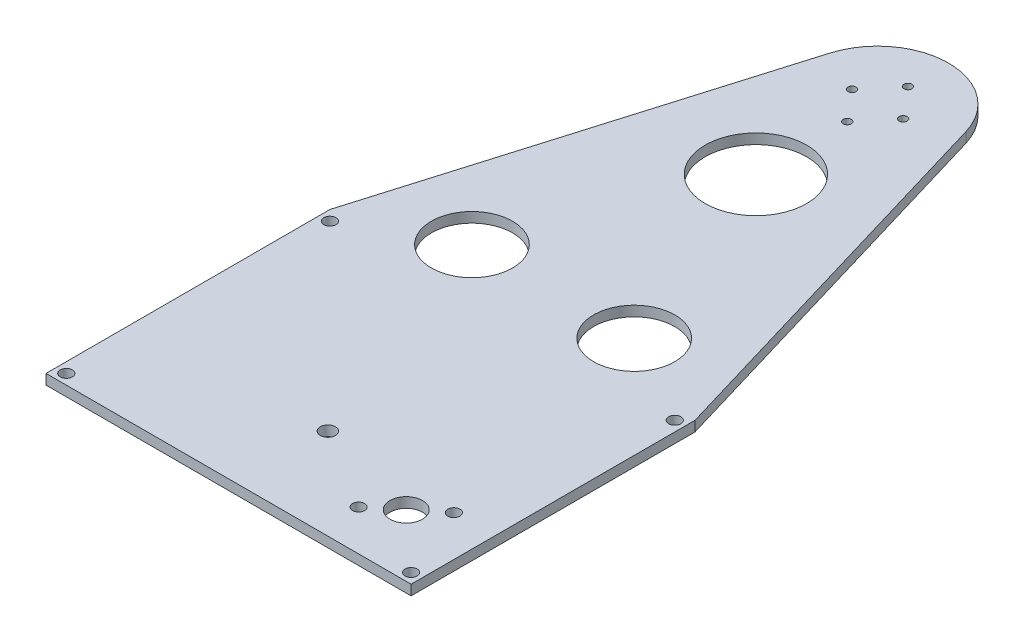
ISO-10303-21;
HEADER;
FILE_DESCRIPTION(('STEP AP214'),'2;1');
FILE_NAME('part.step','',(''),(''),'','','');
FILE_SCHEMA(('AUTOMOTIVE_DESIGN { 1 0 10303 214 1 1 1 1 }'));
ENDSEC;
DATA;
#1=APPLICATION_CONTEXT('core data for automotive mechanical design processes');
#2=APPLICATION_PROTOCOL_DEFINITION('international standard','automotive_design',2000,#1);
#3=PRODUCT_CONTEXT('',#1,'mechanical');
#4=PRODUCT('Part','Part','',(#3));
#5=PRODUCT_RELATED_PRODUCT_CATEGORY('part','',(#4));
#6=PRODUCT_DEFINITION_FORMATION('','',#4);
#7=PRODUCT_DEFINITION_CONTEXT('part definition',#1,'design');
#8=PRODUCT_DEFINITION('design','',#6,#7);
#9=PRODUCT_DEFINITION_SHAPE('','',#8);
#10=(LENGTH_UNIT() NAMED_UNIT(*) SI_UNIT(.MILLI.,.METRE.));
#11=(NAMED_UNIT(*) PLANE_ANGLE_UNIT() SI_UNIT($,.RADIAN.));
#12=(NAMED_UNIT(*) SI_UNIT($,.STERADIAN.) SOLID_ANGLE_UNIT());
#13=UNCERTAINTY_MEASURE_WITH_UNIT(LENGTH_MEASURE(1.E-05),#10,'distance_accuracy_value','');
#14=(GEOMETRIC_REPRESENTATION_CONTEXT(3) GLOBAL_UNCERTAINTY_ASSIGNED_CONTEXT((#13)) GLOBAL_UNIT_ASSIGNED_CONTEXT((#10,
#11,#12)) REPRESENTATION_CONTEXT('',''));
#15=CARTESIAN_POINT('',(0.,0.,0.));
#16=DIRECTION('',(0.,0.,1.));
#17=DIRECTION('',(1.,0.,0.));
#18=AXIS2_PLACEMENT_3D('',#15,#16,#17);
#19=CARTESIAN_POINT('',(0.,15.875,0.));
#20=DIRECTION('',(0.,-1.,0.));
#21=DIRECTION('',(0.,0.,-1.));
#22=AXIS2_PLACEMENT_3D('',#19,#20,#21);
#23=CYLINDRICAL_SURFACE('',#22,22.225);
#24=CARTESIAN_POINT('',(0.,12.7,0.));
#25=DIRECTION('',(0.,1.,0.));
#26=DIRECTION('',(0.,0.,-1.));
#27=AXIS2_PLACEMENT_3D('',#24,#25,#26);
#28=CIRCLE('',#27,22.225);
#29=CARTESIAN_POINT('',(21.3043132570412,12.7,-6.33062885074283));
#30=VERTEX_POINT('',#29);
#31=CARTESIAN_POINT('',(-21.3043132570412,12.7,-6.33062885074282));
#32=VERTEX_POINT('',#31);
#33=EDGE_CURVE('E127',#30,#32,#28,.T.);
#34=ORIENTED_EDGE('',*,*,#33,.T.);
#35=DIRECTION('',(0.,-1.,0.));
#36=VECTOR('',#35,1.);
#37=CARTESIAN_POINT('',(-21.3043132570412,15.875,-6.33062885074282));
#38=LINE('',#37,#36);
#39=CARTESIAN_POINT('',(-21.3043132570412,15.875,-6.33062885074282));
#40=VERTEX_POINT('',#39);
#41=EDGE_CURVE('E11',#40,#32,#38,.T.);
#42=ORIENTED_EDGE('',*,*,#41,.F.);
#43=CARTESIAN_POINT('',(0.,15.875,0.));
#44=DIRECTION('',(0.,1.,0.));
#45=DIRECTION('',(0.,0.,-1.));
#46=AXIS2_PLACEMENT_3D('',#43,#44,#45);
#47=CIRCLE('',#46,22.225);
#48=CARTESIAN_POINT('',(21.3043132570412,15.875,-6.33062885074283));
#49=VERTEX_POINT('',#48);
#50=EDGE_CURVE('E138',#49,#40,#47,.T.);
#51=ORIENTED_EDGE('',*,*,#50,.F.);
#52=DIRECTION('',(0.,-1.,0.));
#53=VECTOR('',#52,1.);
#54=CARTESIAN_POINT('',(21.3043132570412,15.875,-6.33062885074283));
#55=LINE('',#54,#53);
#56=EDGE_CURVE('E123',#49,#30,#55,.T.);
#57=ORIENTED_EDGE('',*,*,#56,.T.);
#58=EDGE_LOOP('',(#34,#42,#51,#57));
#59=FACE_BOUND('',#58,.T.);
#60=ADVANCED_FACE('F41',(#59),#23,.T.);
#61=CARTESIAN_POINT('',(-21.3043132570412,15.875,-6.33062885074282));
#62=DIRECTION('',(0.958574274782507,0.,0.284842692946809));
#63=DIRECTION('',(0.284842692946809,0.,-0.958574274782507));
#64=AXIS2_PLACEMENT_3D('',#61,#62,#63);
#65=PLANE('',#64);
#66=DIRECTION('',(-0.284842692946809,0.,0.958574274782507));
#67=VECTOR('',#66,1.);
#68=CARTESIAN_POINT('',(-21.3043132570412,12.7,-6.33062885074282));
#69=LINE('',#68,#67);
#70=CARTESIAN_POINT('',(-57.1499999999999,12.7,114.3));
#71=VERTEX_POINT('',#70);
#72=EDGE_CURVE('E130',#32,#71,#69,.T.);
#73=ORIENTED_EDGE('',*,*,#72,.T.);
#74=DIRECTION('',(0.,-1.,0.));
#75=VECTOR('',#74,1.);
#76=CARTESIAN_POINT('',(-57.1499999999999,15.875,114.3));
#77=LINE('',#76,#75);
#78=CARTESIAN_POINT('',(-57.1499999999999,15.875,114.3));
#79=VERTEX_POINT('',#78);
#80=EDGE_CURVE('E50',#79,#71,#77,.T.);
#81=ORIENTED_EDGE('',*,*,#80,.F.);
#82=DIRECTION('',(-0.284842692946809,0.,0.958574274782507));
#83=VECTOR('',#82,1.);
#84=CARTESIAN_POINT('',(-21.3043132570412,15.875,-6.33062885074282));
#85=LINE('',#84,#83);
#86=EDGE_CURVE('E96',#40,#79,#85,.T.);
#87=ORIENTED_EDGE('',*,*,#86,.F.);
#88=ORIENTED_EDGE('',*,*,#41,.T.);
#89=EDGE_LOOP('',(#73,#81,#87,#88));
#90=FACE_BOUND('',#89,.T.);
#91=ADVANCED_FACE('F218',(#90),#65,.F.);
#92=CARTESIAN_POINT('',(-57.1499999999999,15.875,114.3));
#93=DIRECTION('',(1.,0.,0.));
#94=DIRECTION('',(0.,0.,-1.));
#95=AXIS2_PLACEMENT_3D('',#92,#93,#94);
#96=PLANE('',#95);
#97=DIRECTION('',(0.,0.,1.));
#98=VECTOR('',#97,1.);
#99=CARTESIAN_POINT('',(-57.1499999999999,12.7,114.3));
#100=LINE('',#99,#98);
#101=CARTESIAN_POINT('',(-57.15,12.7,203.2));
#102=VERTEX_POINT('',#101);
#103=EDGE_CURVE('E133',#71,#102,#100,.T.);
#104=ORIENTED_EDGE('',*,*,#103,.T.);
#105=DIRECTION('',(0.,-1.,0.));
#106=VECTOR('',#105,1.);
#107=CARTESIAN_POINT('',(-57.15,15.875,203.2));
#108=LINE('',#107,#106);
#109=CARTESIAN_POINT('',(-57.15,15.875,203.2));
#110=VERTEX_POINT('',#109);
#111=EDGE_CURVE('E118',#110,#102,#108,.T.);
#112=ORIENTED_EDGE('',*,*,#111,.F.);
#113=DIRECTION('',(0.,0.,1.));
#114=VECTOR('',#113,1.);
#115=CARTESIAN_POINT('',(-57.1499999999999,15.875,114.3));
#116=LINE('',#115,#114);
#117=EDGE_CURVE('E109',#79,#110,#116,.T.);
#118=ORIENTED_EDGE('',*,*,#117,.F.);
#119=ORIENTED_EDGE('',*,*,#80,.T.);
#120=EDGE_LOOP('',(#104,#112,#118,#119));
#121=FACE_BOUND('',#120,.T.);
#122=ADVANCED_FACE('F221',(#121),#96,.F.);
#123=CARTESIAN_POINT('',(-57.15,15.875,203.2));
#124=DIRECTION('',(0.,0.,-1.));
#125=DIRECTION('',(-1.,0.,0.));
#126=AXIS2_PLACEMENT_3D('',#123,#124,#125);
#127=PLANE('',#126);
#128=DIRECTION('',(1.,0.,0.));
#129=VECTOR('',#128,1.);
#130=CARTESIAN_POINT('',(-57.15,12.7,203.2));
#131=LINE('',#130,#129);
#132=CARTESIAN_POINT('',(57.15,12.7,203.2));
#133=VERTEX_POINT('',#132);
#134=EDGE_CURVE('E117',#102,#133,#131,.T.);
#135=ORIENTED_EDGE('',*,*,#134,.T.);
#136=DIRECTION('',(0.,-1.,0.));
#137=VECTOR('',#136,1.);
#138=CARTESIAN_POINT('',(57.15,15.875,203.2));
#139=LINE('',#138,#137);
#140=CARTESIAN_POINT('',(57.15,15.875,203.2));
#141=VERTEX_POINT('',#140);
#142=EDGE_CURVE('E114',#141,#133,#139,.T.);
#143=ORIENTED_EDGE('',*,*,#142,.F.);
#144=DIRECTION('',(1.,0.,0.));
#145=VECTOR('',#144,1.);
#146=CARTESIAN_POINT('',(-57.15,15.875,203.2));
#147=LINE('',#146,#145);
#148=EDGE_CURVE('E103',#110,#141,#147,.T.);
#149=ORIENTED_EDGE('',*,*,#148,.F.);
#150=ORIENTED_EDGE('',*,*,#111,.T.);
#151=EDGE_LOOP('',(#135,#143,#149,#150));
#152=FACE_BOUND('',#151,.T.);
#153=ADVANCED_FACE('F115',(#152),#127,.F.);
#154=CARTESIAN_POINT('',(57.15,15.875,203.2));
#155=DIRECTION('',(-1.,0.,0.));
#156=DIRECTION('',(0.,0.,1.));
#157=AXIS2_PLACEMENT_3D('',#154,#155,#156);
#158=PLANE('',#157);
#159=DIRECTION('',(0.,0.,-1.));
#160=VECTOR('',#159,1.);
#161=CARTESIAN_POINT('',(57.15,12.7,203.2));
#162=LINE('',#161,#160);
#163=CARTESIAN_POINT('',(57.15,12.7,114.3));
#164=VERTEX_POINT('',#163);
#165=EDGE_CURVE('E82',#133,#164,#162,.T.);
#166=ORIENTED_EDGE('',*,*,#165,.T.);
#167=DIRECTION('',(0.,-1.,0.));
#168=VECTOR('',#167,1.);
#169=CARTESIAN_POINT('',(57.15,15.875,114.3));
#170=LINE('',#169,#168);
#171=CARTESIAN_POINT('',(57.15,15.875,114.3));
#172=VERTEX_POINT('',#171);
#173=EDGE_CURVE('E119',#172,#164,#170,.T.);
#174=ORIENTED_EDGE('',*,*,#173,.F.);
#175=DIRECTION('',(0.,0.,-1.));
#176=VECTOR('',#175,1.);
#177=CARTESIAN_POINT('',(57.15,15.875,203.2));
#178=LINE('',#177,#176);
#179=EDGE_CURVE('E107',#141,#172,#178,.T.);
#180=ORIENTED_EDGE('',*,*,#179,.F.);
#181=ORIENTED_EDGE('',*,*,#142,.T.);
#182=EDGE_LOOP('',(#166,#174,#180,#181));
#183=FACE_BOUND('',#182,.T.);
#184=ADVANCED_FACE('F121',(#183),#158,.F.);
#185=CARTESIAN_POINT('',(57.15,15.875,114.3));
#186=DIRECTION('',(-0.958574274782507,0.,0.284842692946809));
#187=DIRECTION('',(0.284842692946809,0.,0.958574274782507));
#188=AXIS2_PLACEMENT_3D('',#185,#186,#187);
#189=PLANE('',#188);
#190=DIRECTION('',(-0.284842692946809,0.,-0.958574274782507));
#191=VECTOR('',#190,1.);
#192=CARTESIAN_POINT('',(57.15,12.7,114.3));
#193=LINE('',#192,#191);
#194=EDGE_CURVE('E88',#164,#30,#193,.T.);
#195=ORIENTED_EDGE('',*,*,#194,.T.);
#196=ORIENTED_EDGE('',*,*,#56,.F.);
#197=DIRECTION('',(-0.284842692946809,0.,-0.958574274782507));
#198=VECTOR('',#197,1.);
#199=CARTESIAN_POINT('',(57.15,15.875,114.3));
#200=LINE('',#199,#198);
#201=EDGE_CURVE('E59',#172,#49,#200,.T.);
#202=ORIENTED_EDGE('',*,*,#201,.F.);
#203=ORIENTED_EDGE('',*,*,#173,.T.);
#204=EDGE_LOOP('',(#195,#196,#202,#203));
#205=FACE_BOUND('',#204,.T.);
#206=ADVANCED_FACE('F226',(#205),#189,.F.);
#207=CARTESIAN_POINT('',(0.,15.875,0.));
#208=DIRECTION('',(0.,-1.,0.));
#209=DIRECTION('',(0.,0.,-1.));
#210=AXIS2_PLACEMENT_3D('',#207,#208,#209);
#211=PLANE('',#210);
#212=CARTESIAN_POINT('',(0.,15.875,38.1));
#213=DIRECTION('',(0.,1.,0.));
#214=DIRECTION('',(0.,0.,1.));
#215=AXIS2_PLACEMENT_3D('',#212,#213,#214);
#216=CIRCLE('',#215,15.875);
#217=CARTESIAN_POINT('',(0.,15.875,53.975));
#218=VERTEX_POINT('',#217);
#219=EDGE_CURVE('E147',#218,#218,#216,.T.);
#220=ORIENTED_EDGE('',*,*,#219,.F.);
#221=EDGE_LOOP('',(#220));
#222=FACE_BOUND('',#221,.T.);
#223=CARTESIAN_POINT('',(-25.4,15.875,101.6));
#224=DIRECTION('',(0.,1.,0.));
#225=DIRECTION('',(0.,0.,1.));
#226=AXIS2_PLACEMENT_3D('',#223,#224,#225);
#227=CIRCLE('',#226,12.7);
#228=CARTESIAN_POINT('',(-25.4,15.875,114.3));
#229=VERTEX_POINT('',#228);
#230=EDGE_CURVE('E487',#229,#229,#227,.T.);
#231=ORIENTED_EDGE('',*,*,#230,.F.);
#232=EDGE_LOOP('',(#231));
#233=FACE_BOUND('',#232,.T.);
#234=CARTESIAN_POINT('',(25.4,15.875,101.6));
#235=DIRECTION('',(0.,1.,0.));
#236=DIRECTION('',(0.,0.,1.));
#237=AXIS2_PLACEMENT_3D('',#234,#235,#236);
#238=CIRCLE('',#237,12.7);
#239=CARTESIAN_POINT('',(25.4,15.875,114.3));
#240=VERTEX_POINT('',#239);
#241=EDGE_CURVE('E490',#240,#240,#238,.T.);
#242=ORIENTED_EDGE('',*,*,#241,.F.);
#243=EDGE_LOOP('',(#242));
#244=FACE_BOUND('',#243,.T.);
#245=CARTESIAN_POINT('',(0.,15.875,-9.5));
#246=DIRECTION('',(0.,1.,0.));
#247=DIRECTION('',(0.,0.,1.));
#248=AXIS2_PLACEMENT_3D('',#245,#246,#247);
#249=CIRCLE('',#248,1.25);
#250=CARTESIAN_POINT('',(0.,15.875,-8.25));
#251=VERTEX_POINT('',#250);
#252=EDGE_CURVE('E495',#251,#251,#249,.T.);
#253=ORIENTED_EDGE('',*,*,#252,.F.);
#254=EDGE_LOOP('',(#253));
#255=FACE_BOUND('',#254,.T.);
#256=CARTESIAN_POINT('',(0.,15.875,9.5));
#257=DIRECTION('',(0.,1.,0.));
#258=DIRECTION('',(0.,0.,1.));
#259=AXIS2_PLACEMENT_3D('',#256,#257,#258);
#260=CIRCLE('',#259,1.25);
#261=CARTESIAN_POINT('',(0.,15.875,10.75));
#262=VERTEX_POINT('',#261);
#263=EDGE_CURVE('E501',#262,#262,#260,.T.);
#264=ORIENTED_EDGE('',*,*,#263,.F.);
#265=EDGE_LOOP('',(#264));
#266=FACE_BOUND('',#265,.T.);
#267=CARTESIAN_POINT('',(-8.,15.875,0.));
#268=DIRECTION('',(0.,1.,0.));
#269=DIRECTION('',(0.,0.,1.));
#270=AXIS2_PLACEMENT_3D('',#267,#268,#269);
#271=CIRCLE('',#270,1.25);
#272=CARTESIAN_POINT('',(-8.,15.875,1.25));
#273=VERTEX_POINT('',#272);
#274=EDGE_CURVE('E161',#273,#273,#271,.T.);
#275=ORIENTED_EDGE('',*,*,#274,.F.);
#276=EDGE_LOOP('',(#275));
#277=FACE_BOUND('',#276,.T.);
#278=CARTESIAN_POINT('',(8.,15.875,0.));
#279=DIRECTION('',(0.,1.,0.));
#280=DIRECTION('',(0.,0.,1.));
#281=AXIS2_PLACEMENT_3D('',#278,#279,#280);
#282=CIRCLE('',#281,1.25);
#283=CARTESIAN_POINT('',(8.,15.875,1.25));
#284=VERTEX_POINT('',#283);
#285=EDGE_CURVE('E152',#284,#284,#282,.T.);
#286=ORIENTED_EDGE('',*,*,#285,.F.);
#287=EDGE_LOOP('',(#286));
#288=FACE_BOUND('',#287,.T.);
#289=CARTESIAN_POINT('',(2.61501830703343,15.875,174.727283435361));
#290=DIRECTION('',(0.,1.,0.));
#291=DIRECTION('',(0.,0.,1.));
#292=AXIS2_PLACEMENT_3D('',#289,#290,#291);
#293=CIRCLE('',#292,2.38125);
#294=CARTESIAN_POINT('',(2.61501830703343,15.875,177.108533435361));
#295=VERTEX_POINT('',#294);
#296=EDGE_CURVE('E181',#295,#295,#293,.T.);
#297=ORIENTED_EDGE('',*,*,#296,.F.);
#298=EDGE_LOOP('',(#297));
#299=FACE_BOUND('',#298,.T.);
#300=CARTESIAN_POINT('',(28.0150183070334,15.875,190.5));
#301=DIRECTION('',(0.,1.,0.));
#302=DIRECTION('',(0.,0.,1.));
#303=AXIS2_PLACEMENT_3D('',#300,#301,#302);
#304=CIRCLE('',#303,1.90499999999999);
#305=CARTESIAN_POINT('',(28.0150183070334,15.875,192.405));
#306=VERTEX_POINT('',#305);
#307=EDGE_CURVE('E175',#306,#306,#304,.T.);
#308=ORIENTED_EDGE('',*,*,#307,.F.);
#309=EDGE_LOOP('',(#308));
#310=FACE_BOUND('',#309,.T.);
#311=CARTESIAN_POINT('',(44.45,15.875,177.108533435361));
#312=DIRECTION('',(0.,1.,0.));
#313=DIRECTION('',(0.,0.,1.));
#314=AXIS2_PLACEMENT_3D('',#311,#312,#313);
#315=CIRCLE('',#314,1.90499999999999);
#316=CARTESIAN_POINT('',(44.45,15.875,179.013533435361));
#317=VERTEX_POINT('',#316);
#318=EDGE_CURVE('E167',#317,#317,#315,.T.);
#319=ORIENTED_EDGE('',*,*,#318,.F.);
#320=EDGE_LOOP('',(#319));
#321=FACE_BOUND('',#320,.T.);
#322=CARTESIAN_POINT('',(36.2325091535167,15.875,183.80426671768));
#323=DIRECTION('',(0.,1.,0.));
#324=DIRECTION('',(0.,0.,1.));
#325=AXIS2_PLACEMENT_3D('',#322,#323,#324);
#326=CIRCLE('',#325,5.07999999999999);
#327=CARTESIAN_POINT('',(36.2325091535167,15.875,188.88426671768));
#328=VERTEX_POINT('',#327);
#329=EDGE_CURVE('E174',#328,#328,#326,.T.);
#330=ORIENTED_EDGE('',*,*,#329,.F.);
#331=EDGE_LOOP('',(#330));
#332=FACE_BOUND('',#331,.T.);
#333=CARTESIAN_POINT('',(53.975,15.875,117.475));
#334=DIRECTION('',(0.,1.,0.));
#335=DIRECTION('',(0.,0.,1.));
#336=AXIS2_PLACEMENT_3D('',#333,#334,#335);
#337=CIRCLE('',#336,1.90500000000001);
#338=CARTESIAN_POINT('',(53.975,15.875,119.38));
#339=VERTEX_POINT('',#338);
#340=EDGE_CURVE('E192',#339,#339,#337,.T.);
#341=ORIENTED_EDGE('',*,*,#340,.F.);
#342=EDGE_LOOP('',(#341));
#343=FACE_BOUND('',#342,.T.);
#344=CARTESIAN_POINT('',(53.975,15.875,200.025));
#345=DIRECTION('',(0.,1.,0.));
#346=DIRECTION('',(0.,0.,1.));
#347=AXIS2_PLACEMENT_3D('',#344,#345,#346);
#348=CIRCLE('',#347,1.905);
#349=CARTESIAN_POINT('',(53.975,15.875,201.93));
#350=VERTEX_POINT('',#349);
#351=EDGE_CURVE('E201',#350,#350,#348,.T.);
#352=ORIENTED_EDGE('',*,*,#351,.F.);
#353=EDGE_LOOP('',(#352));
#354=FACE_BOUND('',#353,.T.);
#355=CARTESIAN_POINT('',(-53.975,15.875,200.025));
#356=DIRECTION('',(0.,1.,0.));
#357=DIRECTION('',(0.,0.,1.));
#358=AXIS2_PLACEMENT_3D('',#355,#356,#357);
#359=CIRCLE('',#358,1.905);
#360=CARTESIAN_POINT('',(-53.975,15.875,201.93));
#361=VERTEX_POINT('',#360);
#362=EDGE_CURVE('E193',#361,#361,#359,.T.);
#363=ORIENTED_EDGE('',*,*,#362,.F.);
#364=EDGE_LOOP('',(#363));
#365=FACE_BOUND('',#364,.T.);
#366=CARTESIAN_POINT('',(-53.975,15.875,117.475));
#367=DIRECTION('',(0.,1.,0.));
#368=DIRECTION('',(0.,0.,1.));
#369=AXIS2_PLACEMENT_3D('',#366,#367,#368);
#370=CIRCLE('',#369,1.90500000000001);
#371=CARTESIAN_POINT('',(-53.975,15.875,119.38));
#372=VERTEX_POINT('',#371);
#373=EDGE_CURVE('E200',#372,#372,#370,.T.);
#374=ORIENTED_EDGE('',*,*,#373,.F.);
#375=EDGE_LOOP('',(#374));
#376=FACE_BOUND('',#375,.T.);
#377=ORIENTED_EDGE('',*,*,#50,.T.);
#378=ORIENTED_EDGE('',*,*,#86,.T.);
#379=ORIENTED_EDGE('',*,*,#117,.T.);
#380=ORIENTED_EDGE('',*,*,#148,.T.);
#381=ORIENTED_EDGE('',*,*,#179,.T.);
#382=ORIENTED_EDGE('',*,*,#201,.T.);
#383=EDGE_LOOP('',(#377,#378,#379,#380,#381,#382));
#384=FACE_BOUND('',#383,.T.);
#385=ADVANCED_FACE('F105',(#222,#233,#244,#255,#266,#277,#288,#299,#310,#321,#332,#343,#354,
#365,#376,#384),#211,.F.);
#386=CARTESIAN_POINT('',(0.,12.7,0.));
#387=DIRECTION('',(0.,-1.,0.));
#388=DIRECTION('',(0.,0.,-1.));
#389=AXIS2_PLACEMENT_3D('',#386,#387,#388);
#390=PLANE('',#389);
#391=CARTESIAN_POINT('',(0.,12.7,38.1));
#392=DIRECTION('',(0.,-1.,0.));
#393=DIRECTION('',(0.,0.,-1.));
#394=AXIS2_PLACEMENT_3D('',#391,#392,#393);
#395=CIRCLE('',#394,15.875);
#396=CARTESIAN_POINT('',(0.,12.7,22.225));
#397=VERTEX_POINT('',#396);
#398=EDGE_CURVE('E44',#397,#397,#395,.T.);
#399=ORIENTED_EDGE('',*,*,#398,.F.);
#400=EDGE_LOOP('',(#399));
#401=FACE_BOUND('',#400,.T.);
#402=CARTESIAN_POINT('',(-25.4,12.7,101.6));
#403=DIRECTION('',(0.,-1.,0.));
#404=DIRECTION('',(0.,0.,-1.));
#405=AXIS2_PLACEMENT_3D('',#402,#403,#404);
#406=CIRCLE('',#405,12.7);
#407=CARTESIAN_POINT('',(-25.4,12.7,88.9));
#408=VERTEX_POINT('',#407);
#409=EDGE_CURVE('E146',#408,#408,#406,.T.);
#410=ORIENTED_EDGE('',*,*,#409,.F.);
#411=EDGE_LOOP('',(#410));
#412=FACE_BOUND('',#411,.T.);
#413=CARTESIAN_POINT('',(25.4,12.7,101.6));
#414=DIRECTION('',(0.,-1.,0.));
#415=DIRECTION('',(0.,0.,-1.));
#416=AXIS2_PLACEMENT_3D('',#413,#414,#415);
#417=CIRCLE('',#416,12.7);
#418=CARTESIAN_POINT('',(25.4,12.7,88.9));
#419=VERTEX_POINT('',#418);
#420=EDGE_CURVE('E144',#419,#419,#417,.T.);
#421=ORIENTED_EDGE('',*,*,#420,.F.);
#422=EDGE_LOOP('',(#421));
#423=FACE_BOUND('',#422,.T.);
#424=CARTESIAN_POINT('',(0.,12.7,-9.5));
#425=DIRECTION('',(0.,-1.,0.));
#426=DIRECTION('',(0.,0.,-1.));
#427=AXIS2_PLACEMENT_3D('',#424,#425,#426);
#428=CIRCLE('',#427,1.25);
#429=CARTESIAN_POINT('',(0.,12.7,-10.75));
#430=VERTEX_POINT('',#429);
#431=EDGE_CURVE('E184',#430,#430,#428,.F.);
#432=ORIENTED_EDGE('',*,*,#431,.T.);
#433=EDGE_LOOP('',(#432));
#434=FACE_BOUND('',#433,.T.);
#435=CARTESIAN_POINT('',(0.,12.7,9.5));
#436=DIRECTION('',(0.,-1.,0.));
#437=DIRECTION('',(0.,0.,-1.));
#438=AXIS2_PLACEMENT_3D('',#435,#436,#437);
#439=CIRCLE('',#438,1.25);
#440=CARTESIAN_POINT('',(0.,12.7,8.25));
#441=VERTEX_POINT('',#440);
#442=EDGE_CURVE('E498',#441,#441,#439,.F.);
#443=ORIENTED_EDGE('',*,*,#442,.T.);
#444=EDGE_LOOP('',(#443));
#445=FACE_BOUND('',#444,.T.);
#446=CARTESIAN_POINT('',(-8.,12.7,0.));
#447=DIRECTION('',(0.,-1.,0.));
#448=DIRECTION('',(0.,0.,-1.));
#449=AXIS2_PLACEMENT_3D('',#446,#447,#448);
#450=CIRCLE('',#449,1.25);
#451=CARTESIAN_POINT('',(-8.,12.7,-1.25));
#452=VERTEX_POINT('',#451);
#453=EDGE_CURVE('E164',#452,#452,#450,.F.);
#454=ORIENTED_EDGE('',*,*,#453,.T.);
#455=EDGE_LOOP('',(#454));
#456=FACE_BOUND('',#455,.T.);
#457=CARTESIAN_POINT('',(8.,12.7,0.));
#458=DIRECTION('',(0.,-1.,0.));
#459=DIRECTION('',(0.,0.,-1.));
#460=AXIS2_PLACEMENT_3D('',#457,#458,#459);
#461=CIRCLE('',#460,1.25);
#462=CARTESIAN_POINT('',(8.,12.7,-1.25));
#463=VERTEX_POINT('',#462);
#464=EDGE_CURVE('E156',#463,#463,#461,.F.);
#465=ORIENTED_EDGE('',*,*,#464,.T.);
#466=EDGE_LOOP('',(#465));
#467=FACE_BOUND('',#466,.T.);
#468=CARTESIAN_POINT('',(2.61501830703343,12.7,174.727283435361));
#469=DIRECTION('',(0.,-1.,0.));
#470=DIRECTION('',(0.,0.,-1.));
#471=AXIS2_PLACEMENT_3D('',#468,#469,#470);
#472=CIRCLE('',#471,2.38125);
#473=CARTESIAN_POINT('',(2.61501830703343,12.7,172.346033435361));
#474=VERTEX_POINT('',#473);
#475=EDGE_CURVE('E178',#474,#474,#472,.F.);
#476=ORIENTED_EDGE('',*,*,#475,.T.);
#477=EDGE_LOOP('',(#476));
#478=FACE_BOUND('',#477,.T.);
#479=CARTESIAN_POINT('',(28.0150183070334,12.7,190.5));
#480=DIRECTION('',(0.,-1.,0.));
#481=DIRECTION('',(0.,0.,-1.));
#482=AXIS2_PLACEMENT_3D('',#479,#480,#481);
#483=CIRCLE('',#482,1.90499999999999);
#484=CARTESIAN_POINT('',(28.0150183070334,12.7,188.595));
#485=VERTEX_POINT('',#484);
#486=EDGE_CURVE('E171',#485,#485,#483,.F.);
#487=ORIENTED_EDGE('',*,*,#486,.T.);
#488=EDGE_LOOP('',(#487));
#489=FACE_BOUND('',#488,.T.);
#490=CARTESIAN_POINT('',(44.45,12.7,177.108533435361));
#491=DIRECTION('',(0.,-1.,0.));
#492=DIRECTION('',(0.,0.,-1.));
#493=AXIS2_PLACEMENT_3D('',#490,#491,#492);
#494=CIRCLE('',#493,1.90499999999999);
#495=CARTESIAN_POINT('',(44.45,12.7,175.203533435361));
#496=VERTEX_POINT('',#495);
#497=EDGE_CURVE('E170',#496,#496,#494,.F.);
#498=ORIENTED_EDGE('',*,*,#497,.T.);
#499=EDGE_LOOP('',(#498));
#500=FACE_BOUND('',#499,.T.);
#501=CARTESIAN_POINT('',(36.2325091535167,12.7,183.80426671768));
#502=DIRECTION('',(0.,-1.,0.));
#503=DIRECTION('',(0.,0.,-1.));
#504=AXIS2_PLACEMENT_3D('',#501,#502,#503);
#505=CIRCLE('',#504,5.07999999999999);
#506=CARTESIAN_POINT('',(36.2325091535167,12.7,178.72426671768));
#507=VERTEX_POINT('',#506);
#508=EDGE_CURVE('E189',#507,#507,#505,.F.);
#509=ORIENTED_EDGE('',*,*,#508,.T.);
#510=EDGE_LOOP('',(#509));
#511=FACE_BOUND('',#510,.T.);
#512=CARTESIAN_POINT('',(53.975,12.7,117.475));
#513=DIRECTION('',(0.,-1.,0.));
#514=DIRECTION('',(0.,0.,-1.));
#515=AXIS2_PLACEMENT_3D('',#512,#513,#514);
#516=CIRCLE('',#515,1.90500000000001);
#517=CARTESIAN_POINT('',(53.975,12.7,115.57));
#518=VERTEX_POINT('',#517);
#519=EDGE_CURVE('E204',#518,#518,#516,.F.);
#520=ORIENTED_EDGE('',*,*,#519,.T.);
#521=EDGE_LOOP('',(#520));
#522=FACE_BOUND('',#521,.T.);
#523=CARTESIAN_POINT('',(53.975,12.7,200.025));
#524=DIRECTION('',(0.,-1.,0.));
#525=DIRECTION('',(0.,0.,-1.));
#526=AXIS2_PLACEMENT_3D('',#523,#524,#525);
#527=CIRCLE('',#526,1.905);
#528=CARTESIAN_POINT('',(53.975,12.7,198.12));
#529=VERTEX_POINT('',#528);
#530=EDGE_CURVE('E197',#529,#529,#527,.F.);
#531=ORIENTED_EDGE('',*,*,#530,.T.);
#532=EDGE_LOOP('',(#531));
#533=FACE_BOUND('',#532,.T.);
#534=CARTESIAN_POINT('',(-53.975,12.7,200.025));
#535=DIRECTION('',(0.,-1.,0.));
#536=DIRECTION('',(0.,0.,-1.));
#537=AXIS2_PLACEMENT_3D('',#534,#535,#536);
#538=CIRCLE('',#537,1.905);
#539=CARTESIAN_POINT('',(-53.975,12.7,198.12));
#540=VERTEX_POINT('',#539);
#541=EDGE_CURVE('E196',#540,#540,#538,.F.);
#542=ORIENTED_EDGE('',*,*,#541,.T.);
#543=EDGE_LOOP('',(#542));
#544=FACE_BOUND('',#543,.T.);
#545=CARTESIAN_POINT('',(-53.975,12.7,117.475));
#546=DIRECTION('',(0.,-1.,0.));
#547=DIRECTION('',(0.,0.,-1.));
#548=AXIS2_PLACEMENT_3D('',#545,#546,#547);
#549=CIRCLE('',#548,1.90500000000001);
#550=CARTESIAN_POINT('',(-53.975,12.7,115.57));
#551=VERTEX_POINT('',#550);
#552=EDGE_CURVE('E131',#551,#551,#549,.F.);
#553=ORIENTED_EDGE('',*,*,#552,.T.);
#554=EDGE_LOOP('',(#553));
#555=FACE_BOUND('',#554,.T.);
#556=ORIENTED_EDGE('',*,*,#33,.F.);
#557=ORIENTED_EDGE('',*,*,#194,.F.);
#558=ORIENTED_EDGE('',*,*,#165,.F.);
#559=ORIENTED_EDGE('',*,*,#134,.F.);
#560=ORIENTED_EDGE('',*,*,#103,.F.);
#561=ORIENTED_EDGE('',*,*,#72,.F.);
#562=EDGE_LOOP('',(#556,#557,#558,#559,#560,#561));
#563=FACE_BOUND('',#562,.T.);
#564=ADVANCED_FACE('F224',(#401,#412,#423,#434,#445,#456,#467,#478,#489,#500,#511,#522,#533,
#544,#555,#563),#390,.T.);
#565=CARTESIAN_POINT('',(-53.975,7.31184632735848,117.475));
#566=DIRECTION('',(0.,1.,0.));
#567=DIRECTION('',(0.,0.,1.));
#568=AXIS2_PLACEMENT_3D('',#565,#566,#567);
#569=CYLINDRICAL_SURFACE('',#568,1.90500000000001);
#570=ORIENTED_EDGE('',*,*,#373,.T.);
#571=EDGE_LOOP('',(#570));
#572=FACE_BOUND('',#571,.T.);
#573=ORIENTED_EDGE('',*,*,#552,.F.);
#574=EDGE_LOOP('',(#573));
#575=FACE_BOUND('',#574,.T.);
#576=ADVANCED_FACE('F267',(#572,#575),#569,.F.);
#577=CARTESIAN_POINT('',(-53.975,7.31184632735848,200.025));
#578=DIRECTION('',(0.,1.,0.));
#579=DIRECTION('',(0.,0.,1.));
#580=AXIS2_PLACEMENT_3D('',#577,#578,#579);
#581=CYLINDRICAL_SURFACE('',#580,1.905);
#582=ORIENTED_EDGE('',*,*,#362,.T.);
#583=EDGE_LOOP('',(#582));
#584=FACE_BOUND('',#583,.T.);
#585=ORIENTED_EDGE('',*,*,#541,.F.);
#586=EDGE_LOOP('',(#585));
#587=FACE_BOUND('',#586,.T.);
#588=ADVANCED_FACE('F272',(#584,#587),#581,.F.);
#589=CARTESIAN_POINT('',(53.975,7.31184632735848,200.025));
#590=DIRECTION('',(0.,1.,0.));
#591=DIRECTION('',(0.,0.,1.));
#592=AXIS2_PLACEMENT_3D('',#589,#590,#591);
#593=CYLINDRICAL_SURFACE('',#592,1.905);
#594=ORIENTED_EDGE('',*,*,#351,.T.);
#595=EDGE_LOOP('',(#594));
#596=FACE_BOUND('',#595,.T.);
#597=ORIENTED_EDGE('',*,*,#530,.F.);
#598=EDGE_LOOP('',(#597));
#599=FACE_BOUND('',#598,.T.);
#600=ADVANCED_FACE('F285',(#596,#599),#593,.F.);
#601=CARTESIAN_POINT('',(53.975,7.31184632735848,117.475));
#602=DIRECTION('',(0.,1.,0.));
#603=DIRECTION('',(0.,0.,1.));
#604=AXIS2_PLACEMENT_3D('',#601,#602,#603);
#605=CYLINDRICAL_SURFACE('',#604,1.90500000000001);
#606=ORIENTED_EDGE('',*,*,#340,.T.);
#607=EDGE_LOOP('',(#606));
#608=FACE_BOUND('',#607,.T.);
#609=ORIENTED_EDGE('',*,*,#519,.F.);
#610=EDGE_LOOP('',(#609));
#611=FACE_BOUND('',#610,.T.);
#612=ADVANCED_FACE('F296',(#608,#611),#605,.F.);
#613=CARTESIAN_POINT('',(36.2325091535167,-1.66840979371064,183.80426671768));
#614=DIRECTION('',(0.,1.,0.));
#615=DIRECTION('',(0.,0.,1.));
#616=AXIS2_PLACEMENT_3D('',#613,#614,#615);
#617=CYLINDRICAL_SURFACE('',#616,5.07999999999999);
#618=ORIENTED_EDGE('',*,*,#329,.T.);
#619=EDGE_LOOP('',(#618));
#620=FACE_BOUND('',#619,.T.);
#621=ORIENTED_EDGE('',*,*,#508,.F.);
#622=EDGE_LOOP('',(#621));
#623=FACE_BOUND('',#622,.T.);
#624=ADVANCED_FACE('F307',(#620,#623),#617,.F.);
#625=CARTESIAN_POINT('',(44.45,-1.66840979371064,177.108533435361));
#626=DIRECTION('',(0.,1.,0.));
#627=DIRECTION('',(0.,0.,1.));
#628=AXIS2_PLACEMENT_3D('',#625,#626,#627);
#629=CYLINDRICAL_SURFACE('',#628,1.90499999999999);
#630=ORIENTED_EDGE('',*,*,#318,.T.);
#631=EDGE_LOOP('',(#630));
#632=FACE_BOUND('',#631,.T.);
#633=ORIENTED_EDGE('',*,*,#497,.F.);
#634=EDGE_LOOP('',(#633));
#635=FACE_BOUND('',#634,.T.);
#636=ADVANCED_FACE('F318',(#632,#635),#629,.F.);
#637=CARTESIAN_POINT('',(28.0150183070334,-1.66840979371064,190.5));
#638=DIRECTION('',(0.,1.,0.));
#639=DIRECTION('',(0.,0.,1.));
#640=AXIS2_PLACEMENT_3D('',#637,#638,#639);
#641=CYLINDRICAL_SURFACE('',#640,1.90499999999999);
#642=ORIENTED_EDGE('',*,*,#307,.T.);
#643=EDGE_LOOP('',(#642));
#644=FACE_BOUND('',#643,.T.);
#645=ORIENTED_EDGE('',*,*,#486,.F.);
#646=EDGE_LOOP('',(#645));
#647=FACE_BOUND('',#646,.T.);
#648=ADVANCED_FACE('F329',(#644,#647),#641,.F.);
#649=CARTESIAN_POINT('',(2.61501830703343,-1.66840979371064,174.727283435361));
#650=DIRECTION('',(0.,1.,0.));
#651=DIRECTION('',(0.,0.,1.));
#652=AXIS2_PLACEMENT_3D('',#649,#650,#651);
#653=CYLINDRICAL_SURFACE('',#652,2.38125);
#654=ORIENTED_EDGE('',*,*,#296,.T.);
#655=EDGE_LOOP('',(#654));
#656=FACE_BOUND('',#655,.T.);
#657=ORIENTED_EDGE('',*,*,#475,.F.);
#658=EDGE_LOOP('',(#657));
#659=FACE_BOUND('',#658,.T.);
#660=ADVANCED_FACE('F340',(#656,#659),#653,.F.);
#661=CARTESIAN_POINT('',(8.,9.16446609406726,0.));
#662=DIRECTION('',(0.,1.,0.));
#663=DIRECTION('',(0.,0.,1.));
#664=AXIS2_PLACEMENT_3D('',#661,#662,#663);
#665=CYLINDRICAL_SURFACE('',#664,1.25);
#666=ORIENTED_EDGE('',*,*,#285,.T.);
#667=EDGE_LOOP('',(#666));
#668=FACE_BOUND('',#667,.T.);
#669=ORIENTED_EDGE('',*,*,#464,.F.);
#670=EDGE_LOOP('',(#669));
#671=FACE_BOUND('',#670,.T.);
#672=ADVANCED_FACE('F351',(#668,#671),#665,.F.);
#673=CARTESIAN_POINT('',(-8.,9.16446609406726,0.));
#674=DIRECTION('',(0.,1.,0.));
#675=DIRECTION('',(0.,0.,1.));
#676=AXIS2_PLACEMENT_3D('',#673,#674,#675);
#677=CYLINDRICAL_SURFACE('',#676,1.25);
#678=ORIENTED_EDGE('',*,*,#274,.T.);
#679=EDGE_LOOP('',(#678));
#680=FACE_BOUND('',#679,.T.);
#681=ORIENTED_EDGE('',*,*,#453,.F.);
#682=EDGE_LOOP('',(#681));
#683=FACE_BOUND('',#682,.T.);
#684=ADVANCED_FACE('F362',(#680,#683),#677,.F.);
#685=CARTESIAN_POINT('',(0.,9.16446609406726,9.5));
#686=DIRECTION('',(0.,1.,0.));
#687=DIRECTION('',(0.,0.,1.));
#688=AXIS2_PLACEMENT_3D('',#685,#686,#687);
#689=CYLINDRICAL_SURFACE('',#688,1.25);
#690=ORIENTED_EDGE('',*,*,#263,.T.);
#691=EDGE_LOOP('',(#690));
#692=FACE_BOUND('',#691,.T.);
#693=ORIENTED_EDGE('',*,*,#442,.F.);
#694=EDGE_LOOP('',(#693));
#695=FACE_BOUND('',#694,.T.);
#696=ADVANCED_FACE('F372',(#692,#695),#689,.F.);
#697=CARTESIAN_POINT('',(0.,9.16446609406726,-9.5));
#698=DIRECTION('',(0.,1.,0.));
#699=DIRECTION('',(0.,0.,1.));
#700=AXIS2_PLACEMENT_3D('',#697,#698,#699);
#701=CYLINDRICAL_SURFACE('',#700,1.25);
#702=ORIENTED_EDGE('',*,*,#252,.T.);
#703=EDGE_LOOP('',(#702));
#704=FACE_BOUND('',#703,.T.);
#705=ORIENTED_EDGE('',*,*,#431,.F.);
#706=EDGE_LOOP('',(#705));
#707=FACE_BOUND('',#706,.T.);
#708=ADVANCED_FACE('F383',(#704,#707),#701,.F.);
#709=CARTESIAN_POINT('',(25.4,-15.875,101.6));
#710=DIRECTION('',(0.,1.,0.));
#711=DIRECTION('',(0.,0.,1.));
#712=AXIS2_PLACEMENT_3D('',#709,#710,#711);
#713=CYLINDRICAL_SURFACE('',#712,12.7);
#714=ORIENTED_EDGE('',*,*,#420,.T.);
#715=EDGE_LOOP('',(#714));
#716=FACE_BOUND('',#715,.T.);
#717=ORIENTED_EDGE('',*,*,#241,.T.);
#718=EDGE_LOOP('',(#717));
#719=FACE_BOUND('',#718,.T.);
#720=ADVANCED_FACE('F394',(#716,#719),#713,.F.);
#721=CARTESIAN_POINT('',(-25.4,-15.875,101.6));
#722=DIRECTION('',(0.,1.,0.));
#723=DIRECTION('',(0.,0.,1.));
#724=AXIS2_PLACEMENT_3D('',#721,#722,#723);
#725=CYLINDRICAL_SURFACE('',#724,12.7);
#726=ORIENTED_EDGE('',*,*,#409,.T.);
#727=EDGE_LOOP('',(#726));
#728=FACE_BOUND('',#727,.T.);
#729=ORIENTED_EDGE('',*,*,#230,.T.);
#730=EDGE_LOOP('',(#729));
#731=FACE_BOUND('',#730,.T.);
#732=ADVANCED_FACE('F418',(#728,#731),#725,.F.);
#733=CARTESIAN_POINT('',(0.,-15.875,38.1));
#734=DIRECTION('',(0.,1.,0.));
#735=DIRECTION('',(0.,0.,1.));
#736=AXIS2_PLACEMENT_3D('',#733,#734,#735);
#737=CYLINDRICAL_SURFACE('',#736,15.875);
#738=ORIENTED_EDGE('',*,*,#398,.T.);
#739=EDGE_LOOP('',(#738));
#740=FACE_BOUND('',#739,.T.);
#741=ORIENTED_EDGE('',*,*,#219,.T.);
#742=EDGE_LOOP('',(#741));
#743=FACE_BOUND('',#742,.T.);
#744=ADVANCED_FACE('F429',(#740,#743),#737,.F.);
#745=CLOSED_SHELL('',(#60,#91,#122,#153,#184,#206,#385,#564,#576,#588,#600,#612,#624,#636,#648,
#660,#672,#684,#696,#708,#720,#732,#744));
#746=MANIFOLD_SOLID_BREP('B2',#745);
#747=ADVANCED_BREP_SHAPE_REPRESENTATION('',(#18,#746),#14);
#748=SHAPE_DEFINITION_REPRESENTATION(#9,#747);
ENDSEC;
END-ISO-10303-21;
